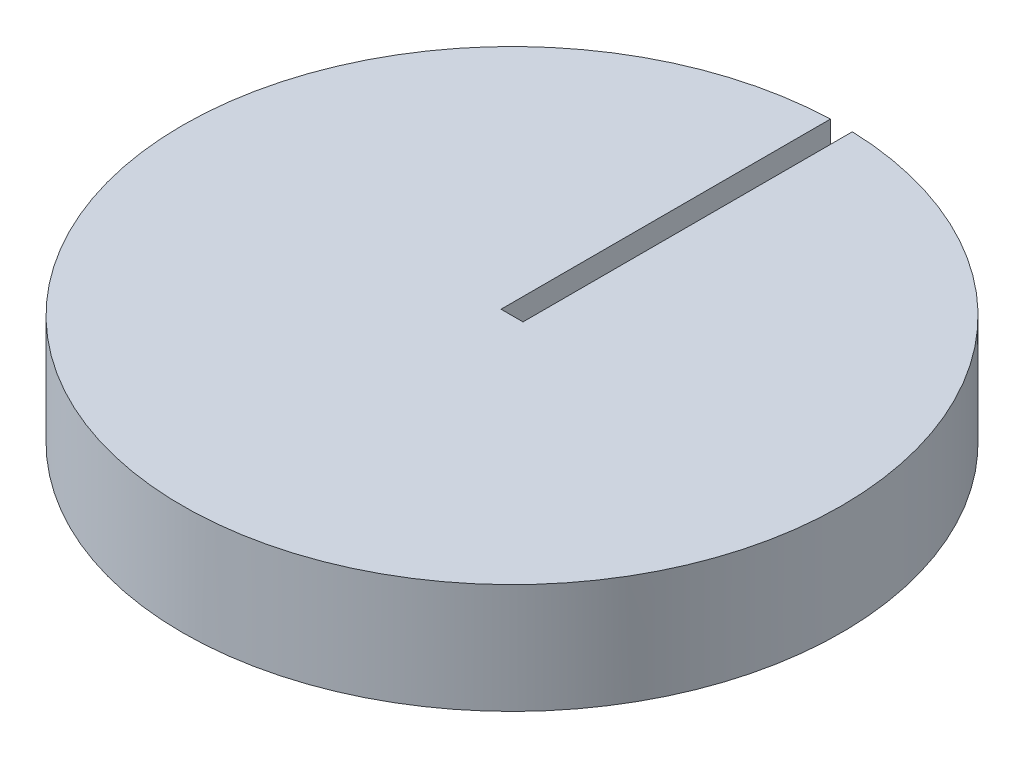
ISO-10303-21;
HEADER;
FILE_DESCRIPTION(('STEP AP214'),'2;1');
FILE_NAME('part.step','',(''),(''),'','','');
FILE_SCHEMA(('AUTOMOTIVE_DESIGN { 1 0 10303 214 1 1 1 1 }'));
ENDSEC;
DATA;
#1=APPLICATION_CONTEXT('core data for automotive mechanical design processes');
#2=APPLICATION_PROTOCOL_DEFINITION('international standard','automotive_design',2000,#1);
#3=PRODUCT_CONTEXT('',#1,'mechanical');
#4=PRODUCT('Part','Part','',(#3));
#5=PRODUCT_RELATED_PRODUCT_CATEGORY('part','',(#4));
#6=PRODUCT_DEFINITION_FORMATION('','',#4);
#7=PRODUCT_DEFINITION_CONTEXT('part definition',#1,'design');
#8=PRODUCT_DEFINITION('design','',#6,#7);
#9=PRODUCT_DEFINITION_SHAPE('','',#8);
#10=(LENGTH_UNIT() NAMED_UNIT(*) SI_UNIT(.MILLI.,.METRE.));
#11=(NAMED_UNIT(*) PLANE_ANGLE_UNIT() SI_UNIT($,.RADIAN.));
#12=(NAMED_UNIT(*) SI_UNIT($,.STERADIAN.) SOLID_ANGLE_UNIT());
#13=UNCERTAINTY_MEASURE_WITH_UNIT(LENGTH_MEASURE(1.E-05),#10,'distance_accuracy_value','');
#14=(GEOMETRIC_REPRESENTATION_CONTEXT(3) GLOBAL_UNCERTAINTY_ASSIGNED_CONTEXT((#13)) GLOBAL_UNIT_ASSIGNED_CONTEXT((#10,
#11,#12)) REPRESENTATION_CONTEXT('',''));
#15=CARTESIAN_POINT('',(0.,0.,0.));
#16=DIRECTION('',(0.,0.,1.));
#17=DIRECTION('',(1.,0.,0.));
#18=AXIS2_PLACEMENT_3D('',#15,#16,#17);
#19=CARTESIAN_POINT('',(0.,12.7,0.));
#20=DIRECTION('',(0.,-1.,0.));
#21=DIRECTION('',(0.,0.,-1.));
#22=AXIS2_PLACEMENT_3D('',#19,#20,#21);
#23=CYLINDRICAL_SURFACE('',#22,38.1);
#24=CARTESIAN_POINT('',(0.,10.16,0.));
#25=DIRECTION('',(0.,-1.,0.));
#26=DIRECTION('',(0.,0.,-1.));
#27=AXIS2_PLACEMENT_3D('',#24,#25,#26);
#28=CIRCLE('',#27,38.1);
#29=CARTESIAN_POINT('',(-1.27,10.16,-38.078827450435));
#30=VERTEX_POINT('',#29);
#31=CARTESIAN_POINT('',(1.27,10.16,-38.078827450435));
#32=VERTEX_POINT('',#31);
#33=EDGE_CURVE('E11',#30,#32,#28,.T.);
#34=ORIENTED_EDGE('',*,*,#33,.T.);
#35=DIRECTION('',(0.,-1.,0.));
#36=VECTOR('',#35,1.);
#37=CARTESIAN_POINT('',(1.27,12.7,-38.078827450435));
#38=LINE('',#37,#36);
#39=CARTESIAN_POINT('',(1.27,12.7,-38.078827450435));
#40=VERTEX_POINT('',#39);
#41=EDGE_CURVE('E54',#32,#40,#38,.F.);
#42=ORIENTED_EDGE('',*,*,#41,.T.);
#43=CARTESIAN_POINT('',(0.,12.7,0.));
#44=DIRECTION('',(0.,1.,0.));
#45=DIRECTION('',(0.,0.,1.));
#46=AXIS2_PLACEMENT_3D('',#43,#44,#45);
#47=CIRCLE('',#46,38.1);
#48=CARTESIAN_POINT('',(-1.27,12.7,-38.078827450435));
#49=VERTEX_POINT('',#48);
#50=EDGE_CURVE('E39',#49,#40,#47,.T.);
#51=ORIENTED_EDGE('',*,*,#50,.F.);
#52=DIRECTION('',(0.,-1.,0.));
#53=VECTOR('',#52,1.);
#54=CARTESIAN_POINT('',(-1.27,12.7,-38.078827450435));
#55=LINE('',#54,#53);
#56=EDGE_CURVE('E46',#30,#49,#55,.F.);
#57=ORIENTED_EDGE('',*,*,#56,.F.);
#58=EDGE_LOOP('',(#34,#42,#51,#57));
#59=FACE_BOUND('',#58,.T.);
#60=CARTESIAN_POINT('',(0.,0.,0.));
#61=DIRECTION('',(0.,1.,0.));
#62=DIRECTION('',(0.,0.,1.));
#63=AXIS2_PLACEMENT_3D('',#60,#61,#62);
#64=CIRCLE('',#63,38.1);
#65=CARTESIAN_POINT('',(0.,0.,38.1));
#66=VERTEX_POINT('',#65);
#67=EDGE_CURVE('E101',#66,#66,#64,.T.);
#68=ORIENTED_EDGE('',*,*,#67,.T.);
#69=EDGE_LOOP('',(#68));
#70=FACE_BOUND('',#69,.T.);
#71=ADVANCED_FACE('F32',(#59,#70),#23,.T.);
#72=CARTESIAN_POINT('',(0.,12.7,0.));
#73=DIRECTION('',(0.,1.,0.));
#74=DIRECTION('',(0.,0.,1.));
#75=AXIS2_PLACEMENT_3D('',#72,#73,#74);
#76=PLANE('',#75);
#77=DIRECTION('',(0.,0.,-1.));
#78=VECTOR('',#77,1.);
#79=CARTESIAN_POINT('',(1.27,12.7,0.));
#80=LINE('',#79,#78);
#81=CARTESIAN_POINT('',(1.27,12.7,0.));
#82=VERTEX_POINT('',#81);
#83=EDGE_CURVE('E94',#82,#40,#80,.T.);
#84=ORIENTED_EDGE('',*,*,#83,.F.);
#85=DIRECTION('',(-1.,0.,0.));
#86=VECTOR('',#85,1.);
#87=CARTESIAN_POINT('',(1.27,12.7,0.));
#88=LINE('',#87,#86);
#89=CARTESIAN_POINT('',(-1.27,12.7,0.));
#90=VERTEX_POINT('',#89);
#91=EDGE_CURVE('E91',#82,#90,#88,.T.);
#92=ORIENTED_EDGE('',*,*,#91,.T.);
#93=DIRECTION('',(0.,0.,-1.));
#94=VECTOR('',#93,1.);
#95=CARTESIAN_POINT('',(-1.27,12.7,0.));
#96=LINE('',#95,#94);
#97=EDGE_CURVE('E85',#90,#49,#96,.T.);
#98=ORIENTED_EDGE('',*,*,#97,.T.);
#99=ORIENTED_EDGE('',*,*,#50,.T.);
#100=EDGE_LOOP('',(#84,#92,#98,#99));
#101=FACE_BOUND('',#100,.T.);
#102=ADVANCED_FACE('F109',(#101),#76,.T.);
#103=CARTESIAN_POINT('',(0.,0.,0.));
#104=DIRECTION('',(0.,1.,0.));
#105=DIRECTION('',(0.,0.,1.));
#106=AXIS2_PLACEMENT_3D('',#103,#104,#105);
#107=PLANE('',#106);
#108=ORIENTED_EDGE('',*,*,#67,.F.);
#109=EDGE_LOOP('',(#108));
#110=FACE_BOUND('',#109,.T.);
#111=ADVANCED_FACE('F107',(#110),#107,.F.);
#112=CARTESIAN_POINT('',(0.,10.16,0.));
#113=DIRECTION('',(0.,-1.,0.));
#114=DIRECTION('',(-1.,0.,0.));
#115=AXIS2_PLACEMENT_3D('',#112,#113,#114);
#116=PLANE('',#115);
#117=DIRECTION('',(0.,0.,-1.));
#118=VECTOR('',#117,1.);
#119=CARTESIAN_POINT('',(-1.27,10.16,0.));
#120=LINE('',#119,#118);
#121=CARTESIAN_POINT('',(-1.27,10.16,0.));
#122=VERTEX_POINT('',#121);
#123=EDGE_CURVE('E82',#122,#30,#120,.T.);
#124=ORIENTED_EDGE('',*,*,#123,.F.);
#125=DIRECTION('',(-1.,0.,0.));
#126=VECTOR('',#125,1.);
#127=CARTESIAN_POINT('',(1.27,10.16,0.));
#128=LINE('',#127,#126);
#129=CARTESIAN_POINT('',(1.27,10.16,0.));
#130=VERTEX_POINT('',#129);
#131=EDGE_CURVE('E74',#130,#122,#128,.T.);
#132=ORIENTED_EDGE('',*,*,#131,.F.);
#133=DIRECTION('',(0.,0.,-1.));
#134=VECTOR('',#133,1.);
#135=CARTESIAN_POINT('',(1.27,10.16,0.));
#136=LINE('',#135,#134);
#137=EDGE_CURVE('E89',#130,#32,#136,.T.);
#138=ORIENTED_EDGE('',*,*,#137,.T.);
#139=ORIENTED_EDGE('',*,*,#33,.F.);
#140=EDGE_LOOP('',(#124,#132,#138,#139));
#141=FACE_BOUND('',#140,.T.);
#142=ADVANCED_FACE('F88',(#141),#116,.F.);
#143=CARTESIAN_POINT('',(1.27,10.16,0.));
#144=DIRECTION('',(1.,0.,0.));
#145=DIRECTION('',(0.,0.,-1.));
#146=AXIS2_PLACEMENT_3D('',#143,#144,#145);
#147=PLANE('',#146);
#148=ORIENTED_EDGE('',*,*,#137,.F.);
#149=DIRECTION('',(0.,1.,0.));
#150=VECTOR('',#149,1.);
#151=CARTESIAN_POINT('',(1.27,10.16,0.));
#152=LINE('',#151,#150);
#153=EDGE_CURVE('E79',#130,#82,#152,.T.);
#154=ORIENTED_EDGE('',*,*,#153,.T.);
#155=ORIENTED_EDGE('',*,*,#83,.T.);
#156=ORIENTED_EDGE('',*,*,#41,.F.);
#157=EDGE_LOOP('',(#148,#154,#155,#156));
#158=FACE_BOUND('',#157,.T.);
#159=ADVANCED_FACE('F114',(#158),#147,.F.);
#160=CARTESIAN_POINT('',(-1.27,10.16,0.));
#161=DIRECTION('',(1.,0.,0.));
#162=DIRECTION('',(0.,0.,-1.));
#163=AXIS2_PLACEMENT_3D('',#160,#161,#162);
#164=PLANE('',#163);
#165=ORIENTED_EDGE('',*,*,#56,.T.);
#166=ORIENTED_EDGE('',*,*,#97,.F.);
#167=DIRECTION('',(0.,1.,0.));
#168=VECTOR('',#167,1.);
#169=CARTESIAN_POINT('',(-1.27,10.16,0.));
#170=LINE('',#169,#168);
#171=EDGE_CURVE('E78',#122,#90,#170,.T.);
#172=ORIENTED_EDGE('',*,*,#171,.F.);
#173=ORIENTED_EDGE('',*,*,#123,.T.);
#174=EDGE_LOOP('',(#165,#166,#172,#173));
#175=FACE_BOUND('',#174,.T.);
#176=ADVANCED_FACE('F84',(#175),#164,.T.);
#177=CARTESIAN_POINT('',(1.27,10.16,0.));
#178=DIRECTION('',(0.,0.,-1.));
#179=DIRECTION('',(-1.,0.,0.));
#180=AXIS2_PLACEMENT_3D('',#177,#178,#179);
#181=PLANE('',#180);
#182=ORIENTED_EDGE('',*,*,#91,.F.);
#183=ORIENTED_EDGE('',*,*,#153,.F.);
#184=ORIENTED_EDGE('',*,*,#131,.T.);
#185=ORIENTED_EDGE('',*,*,#171,.T.);
#186=EDGE_LOOP('',(#182,#183,#184,#185));
#187=FACE_BOUND('',#186,.T.);
#188=ADVANCED_FACE('F77',(#187),#181,.T.);
#189=CLOSED_SHELL('',(#71,#102,#111,#142,#159,#176,#188));
#190=MANIFOLD_SOLID_BREP('B2',#189);
#191=ADVANCED_BREP_SHAPE_REPRESENTATION('',(#18,#190),#14);
#192=SHAPE_DEFINITION_REPRESENTATION(#9,#191);
ENDSEC;
END-ISO-10303-21;
